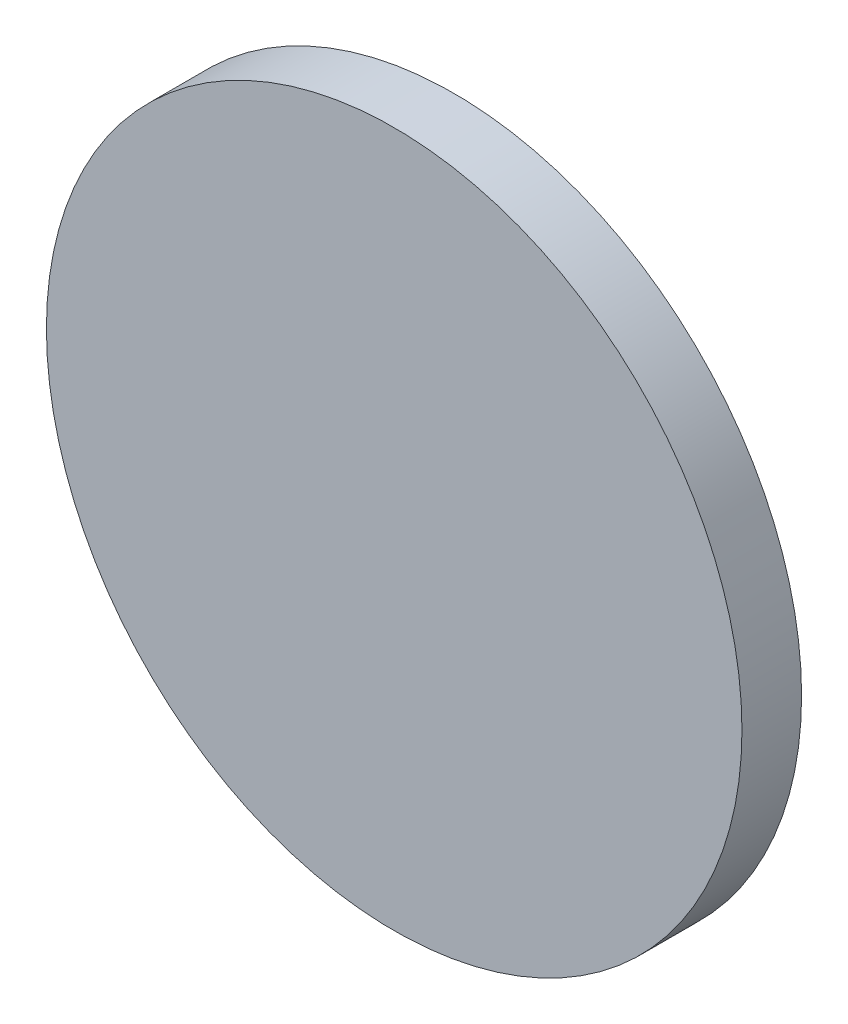
ISO-10303-21;
HEADER;
FILE_DESCRIPTION(('STEP AP214'),'2;1');
FILE_NAME('part.step','',(''),(''),'','','');
FILE_SCHEMA(('AUTOMOTIVE_DESIGN { 1 0 10303 214 1 1 1 1 }'));
ENDSEC;
DATA;
#1=APPLICATION_CONTEXT('core data for automotive mechanical design processes');
#2=APPLICATION_PROTOCOL_DEFINITION('international standard','automotive_design',2000,#1);
#3=PRODUCT_CONTEXT('',#1,'mechanical');
#4=PRODUCT('Part','Part','',(#3));
#5=PRODUCT_RELATED_PRODUCT_CATEGORY('part','',(#4));
#6=PRODUCT_DEFINITION_FORMATION('','',#4);
#7=PRODUCT_DEFINITION_CONTEXT('part definition',#1,'design');
#8=PRODUCT_DEFINITION('design','',#6,#7);
#9=PRODUCT_DEFINITION_SHAPE('','',#8);
#10=(LENGTH_UNIT() NAMED_UNIT(*) SI_UNIT(.MILLI.,.METRE.));
#11=(NAMED_UNIT(*) PLANE_ANGLE_UNIT() SI_UNIT($,.RADIAN.));
#12=(NAMED_UNIT(*) SI_UNIT($,.STERADIAN.) SOLID_ANGLE_UNIT());
#13=UNCERTAINTY_MEASURE_WITH_UNIT(LENGTH_MEASURE(1.E-05),#10,'distance_accuracy_value','');
#14=(GEOMETRIC_REPRESENTATION_CONTEXT(3) GLOBAL_UNCERTAINTY_ASSIGNED_CONTEXT((#13)) GLOBAL_UNIT_ASSIGNED_CONTEXT((#10,
#11,#12)) REPRESENTATION_CONTEXT('',''));
#15=CARTESIAN_POINT('',(0.,0.,0.));
#16=DIRECTION('',(0.,0.,1.));
#17=DIRECTION('',(1.,0.,0.));
#18=AXIS2_PLACEMENT_3D('',#15,#16,#17);
#19=CARTESIAN_POINT('',(3.3655,8.991600006176,0.));
#20=DIRECTION('',(0.,0.,-1.));
#21=DIRECTION('',(-1.,0.,0.));
#22=AXIS2_PLACEMENT_3D('',#19,#20,#21);
#23=PLANE('',#22);
#24=CARTESIAN_POINT('',(3.3655,8.991600006176,0.));
#25=DIRECTION('',(0.,0.,1.));
#26=DIRECTION('',(1.,0.,0.));
#27=AXIS2_PLACEMENT_3D('',#24,#25,#26);
#28=CIRCLE('',#27,0.200024667);
#29=CARTESIAN_POINT('',(3.565524667,8.991600006176,0.));
#30=VERTEX_POINT('',#29);
#31=EDGE_CURVE('E18',#30,#30,#28,.T.);
#32=ORIENTED_EDGE('',*,*,#31,.F.);
#33=EDGE_LOOP('',(#32));
#34=FACE_BOUND('',#33,.T.);
#35=ADVANCED_FACE('F15',(#34),#23,.T.);
#36=CARTESIAN_POINT('',(3.3655,8.991600006176,0.));
#37=DIRECTION('',(0.,0.,1.));
#38=DIRECTION('',(1.,0.,0.));
#39=AXIS2_PLACEMENT_3D('',#36,#37,#38);
#40=CYLINDRICAL_SURFACE('',#39,0.200024667);
#41=CARTESIAN_POINT('',(3.3655,8.991600006176,0.03429));
#42=DIRECTION('',(0.,0.,1.));
#43=DIRECTION('',(1.,0.,0.));
#44=AXIS2_PLACEMENT_3D('',#41,#42,#43);
#45=CIRCLE('',#44,0.200024667);
#46=CARTESIAN_POINT('',(3.565524667,8.991600006176,0.03429));
#47=VERTEX_POINT('',#46);
#48=EDGE_CURVE('E10',#47,#47,#45,.T.);
#49=ORIENTED_EDGE('',*,*,#48,.F.);
#50=EDGE_LOOP('',(#49));
#51=FACE_BOUND('',#50,.T.);
#52=ORIENTED_EDGE('',*,*,#31,.T.);
#53=EDGE_LOOP('',(#52));
#54=FACE_BOUND('',#53,.T.);
#55=ADVANCED_FACE('F27',(#51,#54),#40,.T.);
#56=CARTESIAN_POINT('',(3.3655,8.991600006176,0.03429));
#57=DIRECTION('',(0.,0.,1.));
#58=DIRECTION('',(1.,0.,0.));
#59=AXIS2_PLACEMENT_3D('',#56,#57,#58);
#60=PLANE('',#59);
#61=ORIENTED_EDGE('',*,*,#48,.T.);
#62=EDGE_LOOP('',(#61));
#63=FACE_BOUND('',#62,.T.);
#64=ADVANCED_FACE('F34',(#63),#60,.T.);
#65=CLOSED_SHELL('',(#35,#55,#64));
#66=MANIFOLD_SOLID_BREP('B1',#65);
#67=ADVANCED_BREP_SHAPE_REPRESENTATION('',(#18,#66),#14);
#68=SHAPE_DEFINITION_REPRESENTATION(#9,#67);
ENDSEC;
END-ISO-10303-21;
